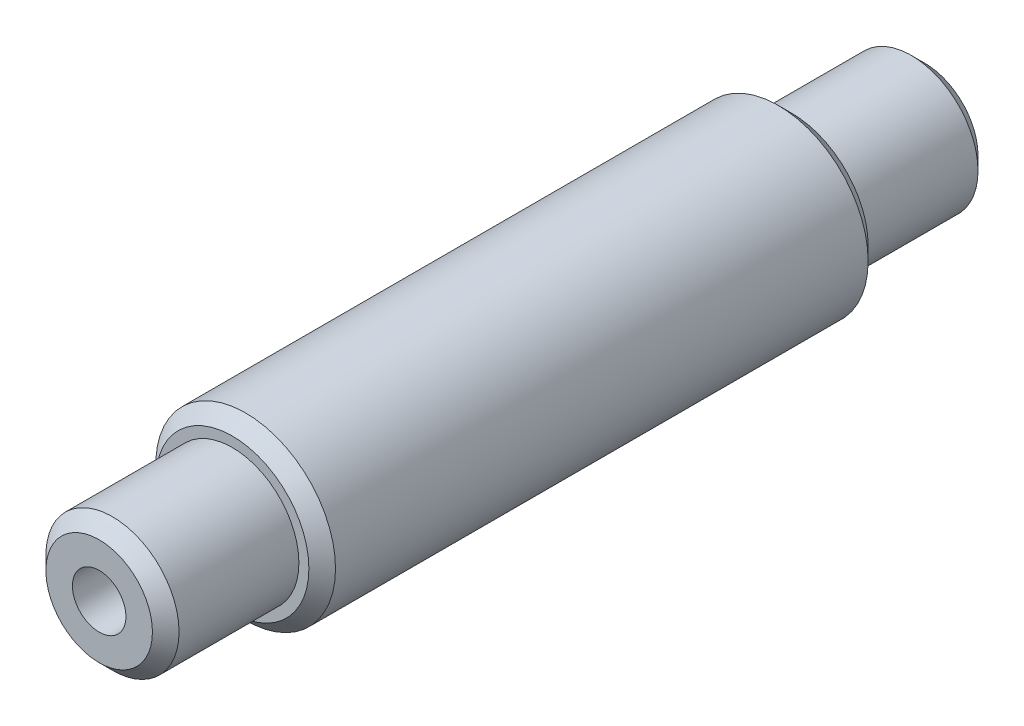
ISO-10303-21;
HEADER;
FILE_DESCRIPTION(('STEP AP214'),'2;1');
FILE_NAME('part.step','',(''),(''),'','','');
FILE_SCHEMA(('AUTOMOTIVE_DESIGN { 1 0 10303 214 1 1 1 1 }'));
ENDSEC;
DATA;
#1=APPLICATION_CONTEXT('core data for automotive mechanical design processes');
#2=APPLICATION_PROTOCOL_DEFINITION('international standard','automotive_design',2000,#1);
#3=PRODUCT_CONTEXT('',#1,'mechanical');
#4=PRODUCT('Part','Part','',(#3));
#5=PRODUCT_RELATED_PRODUCT_CATEGORY('part','',(#4));
#6=PRODUCT_DEFINITION_FORMATION('','',#4);
#7=PRODUCT_DEFINITION_CONTEXT('part definition',#1,'design');
#8=PRODUCT_DEFINITION('design','',#6,#7);
#9=PRODUCT_DEFINITION_SHAPE('','',#8);
#10=(LENGTH_UNIT() NAMED_UNIT(*) SI_UNIT(.MILLI.,.METRE.));
#11=(NAMED_UNIT(*) PLANE_ANGLE_UNIT() SI_UNIT($,.RADIAN.));
#12=(NAMED_UNIT(*) SI_UNIT($,.STERADIAN.) SOLID_ANGLE_UNIT());
#13=UNCERTAINTY_MEASURE_WITH_UNIT(LENGTH_MEASURE(1.E-05),#10,'distance_accuracy_value','');
#14=(GEOMETRIC_REPRESENTATION_CONTEXT(3) GLOBAL_UNCERTAINTY_ASSIGNED_CONTEXT((#13)) GLOBAL_UNIT_ASSIGNED_CONTEXT((#10,
#11,#12)) REPRESENTATION_CONTEXT('',''));
#15=CARTESIAN_POINT('',(0.,0.,0.));
#16=DIRECTION('',(0.,0.,1.));
#17=DIRECTION('',(1.,0.,0.));
#18=AXIS2_PLACEMENT_3D('',#15,#16,#17);
#19=CARTESIAN_POINT('',(0.,0.,26.67));
#20=DIRECTION('',(0.,0.,1.));
#21=DIRECTION('',(1.,0.,0.));
#22=AXIS2_PLACEMENT_3D('',#19,#20,#21);
#23=PLANE('',#22);
#24=CARTESIAN_POINT('',(0.,0.,26.67));
#25=DIRECTION('',(0.,0.,1.));
#26=DIRECTION('',(1.,0.,0.));
#27=AXIS2_PLACEMENT_3D('',#24,#25,#26);
#28=CIRCLE('',#27,7.30250000000001);
#29=CARTESIAN_POINT('',(7.30250000000001,0.,26.67));
#30=VERTEX_POINT('',#29);
#31=EDGE_CURVE('E111',#30,#30,#28,.T.);
#32=ORIENTED_EDGE('',*,*,#31,.T.);
#33=EDGE_LOOP('',(#32));
#34=FACE_BOUND('',#33,.T.);
#35=CARTESIAN_POINT('',(0.,0.,26.67));
#36=DIRECTION('',(0.,0.,1.));
#37=DIRECTION('',(1.,0.,0.));
#38=AXIS2_PLACEMENT_3D('',#35,#36,#37);
#39=CIRCLE('',#38,6.35);
#40=CARTESIAN_POINT('',(6.35,0.,26.67));
#41=VERTEX_POINT('',#40);
#42=EDGE_CURVE('E87',#41,#41,#39,.T.);
#43=ORIENTED_EDGE('',*,*,#42,.F.);
#44=EDGE_LOOP('',(#43));
#45=FACE_BOUND('',#44,.T.);
#46=ADVANCED_FACE('F43',(#34,#45),#23,.T.);
#47=CARTESIAN_POINT('',(0.,0.,-26.67));
#48=DIRECTION('',(0.,0.,1.));
#49=DIRECTION('',(1.,0.,0.));
#50=AXIS2_PLACEMENT_3D('',#47,#48,#49);
#51=PLANE('',#50);
#52=CARTESIAN_POINT('',(0.,0.,-26.67));
#53=DIRECTION('',(0.,0.,1.));
#54=DIRECTION('',(1.,0.,0.));
#55=AXIS2_PLACEMENT_3D('',#52,#53,#54);
#56=CIRCLE('',#55,7.3025);
#57=CARTESIAN_POINT('',(7.3025,0.,-26.67));
#58=VERTEX_POINT('',#57);
#59=EDGE_CURVE('E107',#58,#58,#56,.F.);
#60=ORIENTED_EDGE('',*,*,#59,.T.);
#61=EDGE_LOOP('',(#60));
#62=FACE_BOUND('',#61,.T.);
#63=CARTESIAN_POINT('',(0.,0.,-26.67));
#64=DIRECTION('',(0.,0.,1.));
#65=DIRECTION('',(1.,0.,0.));
#66=AXIS2_PLACEMENT_3D('',#63,#64,#65);
#67=CIRCLE('',#66,6.35);
#68=CARTESIAN_POINT('',(6.35,0.,-26.67));
#69=VERTEX_POINT('',#68);
#70=EDGE_CURVE('E83',#69,#69,#67,.F.);
#71=ORIENTED_EDGE('',*,*,#70,.F.);
#72=EDGE_LOOP('',(#71));
#73=FACE_BOUND('',#72,.T.);
#74=ADVANCED_FACE('F133',(#62,#73),#51,.F.);
#75=CARTESIAN_POINT('',(0.,0.,26.67));
#76=DIRECTION('',(0.,0.,-1.));
#77=DIRECTION('',(-1.,0.,0.));
#78=AXIS2_PLACEMENT_3D('',#75,#76,#77);
#79=CYLINDRICAL_SURFACE('',#78,8.5725);
#80=CARTESIAN_POINT('',(0.,0.,-25.4));
#81=DIRECTION('',(0.,0.,1.));
#82=DIRECTION('',(1.,0.,0.));
#83=AXIS2_PLACEMENT_3D('',#80,#81,#82);
#84=CIRCLE('',#83,8.5725);
#85=CARTESIAN_POINT('',(8.5725,0.,-25.4));
#86=VERTEX_POINT('',#85);
#87=EDGE_CURVE('E103',#86,#86,#84,.T.);
#88=ORIENTED_EDGE('',*,*,#87,.T.);
#89=EDGE_LOOP('',(#88));
#90=FACE_BOUND('',#89,.T.);
#91=CARTESIAN_POINT('',(0.,0.,25.4));
#92=DIRECTION('',(0.,0.,1.));
#93=DIRECTION('',(1.,0.,0.));
#94=AXIS2_PLACEMENT_3D('',#91,#92,#93);
#95=CIRCLE('',#94,8.5725);
#96=CARTESIAN_POINT('',(8.5725,0.,25.4));
#97=VERTEX_POINT('',#96);
#98=EDGE_CURVE('E99',#97,#97,#95,.F.);
#99=ORIENTED_EDGE('',*,*,#98,.T.);
#100=EDGE_LOOP('',(#99));
#101=FACE_BOUND('',#100,.T.);
#102=ADVANCED_FACE('F139',(#90,#101),#79,.T.);
#103=CARTESIAN_POINT('',(0.,0.,-39.37));
#104=DIRECTION('',(0.,0.,1.));
#105=DIRECTION('',(1.,0.,0.));
#106=AXIS2_PLACEMENT_3D('',#103,#104,#105);
#107=PLANE('',#106);
#108=CARTESIAN_POINT('',(0.,0.,-39.37));
#109=DIRECTION('',(0.,0.,-1.));
#110=DIRECTION('',(-1.,0.,0.));
#111=AXIS2_PLACEMENT_3D('',#108,#109,#110);
#112=CIRCLE('',#111,2.55269999999999);
#113=CARTESIAN_POINT('',(-2.55269999999999,0.,-39.37));
#114=VERTEX_POINT('',#113);
#115=EDGE_CURVE('E69',#114,#114,#112,.T.);
#116=ORIENTED_EDGE('',*,*,#115,.F.);
#117=EDGE_LOOP('',(#116));
#118=FACE_BOUND('',#117,.T.);
#119=CARTESIAN_POINT('',(0.,0.,-39.37));
#120=DIRECTION('',(0.,0.,1.));
#121=DIRECTION('',(1.,0.,0.));
#122=AXIS2_PLACEMENT_3D('',#119,#120,#121);
#123=CIRCLE('',#122,5.07999999999999);
#124=CARTESIAN_POINT('',(5.07999999999999,0.,-39.37));
#125=VERTEX_POINT('',#124);
#126=EDGE_CURVE('E95',#125,#125,#123,.F.);
#127=ORIENTED_EDGE('',*,*,#126,.T.);
#128=EDGE_LOOP('',(#127));
#129=FACE_BOUND('',#128,.T.);
#130=ADVANCED_FACE('F149',(#118,#129),#107,.F.);
#131=CARTESIAN_POINT('',(0.,0.,39.37));
#132=DIRECTION('',(0.,0.,-1.));
#133=DIRECTION('',(-1.,0.,0.));
#134=AXIS2_PLACEMENT_3D('',#131,#132,#133);
#135=CYLINDRICAL_SURFACE('',#134,6.35);
#136=CARTESIAN_POINT('',(0.,0.,-38.1));
#137=DIRECTION('',(0.,0.,1.));
#138=DIRECTION('',(1.,0.,0.));
#139=AXIS2_PLACEMENT_3D('',#136,#137,#138);
#140=CIRCLE('',#139,6.35);
#141=CARTESIAN_POINT('',(6.35,0.,-38.1));
#142=VERTEX_POINT('',#141);
#143=EDGE_CURVE('E91',#142,#142,#140,.T.);
#144=ORIENTED_EDGE('',*,*,#143,.T.);
#145=EDGE_LOOP('',(#144));
#146=FACE_BOUND('',#145,.T.);
#147=ORIENTED_EDGE('',*,*,#70,.T.);
#148=EDGE_LOOP('',(#147));
#149=FACE_BOUND('',#148,.T.);
#150=ADVANCED_FACE('F169',(#146,#149),#135,.T.);
#151=CARTESIAN_POINT('',(0.,0.,38.1));
#152=DIRECTION('',(0.,0.,1.));
#153=DIRECTION('',(1.,0.,0.));
#154=AXIS2_PLACEMENT_3D('',#151,#152,#153);
#155=CIRCLE('',#154,6.35);
#156=CARTESIAN_POINT('',(6.35,0.,38.1));
#157=VERTEX_POINT('',#156);
#158=EDGE_CURVE('E11',#157,#157,#155,.F.);
#159=ORIENTED_EDGE('',*,*,#158,.T.);
#160=EDGE_LOOP('',(#159));
#161=FACE_BOUND('',#160,.T.);
#162=ORIENTED_EDGE('',*,*,#42,.T.);
#163=EDGE_LOOP('',(#162));
#164=FACE_BOUND('',#163,.T.);
#165=ADVANCED_FACE('F144',(#161,#164),#135,.T.);
#166=CARTESIAN_POINT('',(0.,0.,39.37));
#167=DIRECTION('',(0.,0.,1.));
#168=DIRECTION('',(1.,0.,0.));
#169=AXIS2_PLACEMENT_3D('',#166,#167,#168);
#170=PLANE('',#169);
#171=CARTESIAN_POINT('',(0.,0.,39.37));
#172=DIRECTION('',(0.,0.,1.));
#173=DIRECTION('',(1.,0.,0.));
#174=AXIS2_PLACEMENT_3D('',#171,#172,#173);
#175=CIRCLE('',#174,2.55269999999999);
#176=CARTESIAN_POINT('',(2.55269999999999,0.,39.37));
#177=VERTEX_POINT('',#176);
#178=EDGE_CURVE('E70',#177,#177,#175,.T.);
#179=ORIENTED_EDGE('',*,*,#178,.F.);
#180=EDGE_LOOP('',(#179));
#181=FACE_BOUND('',#180,.T.);
#182=CARTESIAN_POINT('',(0.,0.,39.37));
#183=DIRECTION('',(0.,0.,1.));
#184=DIRECTION('',(1.,0.,0.));
#185=AXIS2_PLACEMENT_3D('',#182,#183,#184);
#186=CIRCLE('',#185,5.08000000000002);
#187=CARTESIAN_POINT('',(5.08000000000002,0.,39.37));
#188=VERTEX_POINT('',#187);
#189=EDGE_CURVE('E52',#188,#188,#186,.T.);
#190=ORIENTED_EDGE('',*,*,#189,.T.);
#191=EDGE_LOOP('',(#190));
#192=FACE_BOUND('',#191,.T.);
#193=ADVANCED_FACE('F118',(#181,#192),#170,.T.);
#194=CARTESIAN_POINT('',(0.,0.,-38.1));
#195=DIRECTION('',(0.,0.,1.));
#196=DIRECTION('',(1.,0.,0.));
#197=AXIS2_PLACEMENT_3D('',#194,#195,#196);
#198=CONICAL_SURFACE('',#197,6.35,0.785398163397456);
#199=ORIENTED_EDGE('',*,*,#126,.F.);
#200=EDGE_LOOP('',(#199));
#201=FACE_BOUND('',#200,.T.);
#202=ORIENTED_EDGE('',*,*,#143,.F.);
#203=EDGE_LOOP('',(#202));
#204=FACE_BOUND('',#203,.T.);
#205=ADVANCED_FACE('F151',(#201,#204),#198,.T.);
#206=CARTESIAN_POINT('',(0.,0.,-25.4));
#207=DIRECTION('',(0.,0.,1.));
#208=DIRECTION('',(1.,0.,0.));
#209=AXIS2_PLACEMENT_3D('',#206,#207,#208);
#210=CONICAL_SURFACE('',#209,8.5725,0.78539816339745);
#211=ORIENTED_EDGE('',*,*,#59,.F.);
#212=EDGE_LOOP('',(#211));
#213=FACE_BOUND('',#212,.T.);
#214=ORIENTED_EDGE('',*,*,#87,.F.);
#215=EDGE_LOOP('',(#214));
#216=FACE_BOUND('',#215,.T.);
#217=ADVANCED_FACE('F129',(#213,#216),#210,.T.);
#218=CARTESIAN_POINT('',(0.,0.,26.67));
#219=DIRECTION('',(0.,0.,-1.));
#220=DIRECTION('',(-1.,0.,0.));
#221=AXIS2_PLACEMENT_3D('',#218,#219,#220);
#222=CONICAL_SURFACE('',#221,7.30250000000001,0.78539816339745);
#223=ORIENTED_EDGE('',*,*,#98,.F.);
#224=EDGE_LOOP('',(#223));
#225=FACE_BOUND('',#224,.T.);
#226=ORIENTED_EDGE('',*,*,#31,.F.);
#227=EDGE_LOOP('',(#226));
#228=FACE_BOUND('',#227,.T.);
#229=ADVANCED_FACE('F122',(#225,#228),#222,.T.);
#230=CARTESIAN_POINT('',(0.,0.,39.37));
#231=DIRECTION('',(0.,0.,-1.));
#232=DIRECTION('',(-1.,0.,0.));
#233=AXIS2_PLACEMENT_3D('',#230,#231,#232);
#234=CONICAL_SURFACE('',#233,5.08000000000002,0.785398163397445);
#235=ORIENTED_EDGE('',*,*,#158,.F.);
#236=EDGE_LOOP('',(#235));
#237=FACE_BOUND('',#236,.T.);
#238=ORIENTED_EDGE('',*,*,#189,.F.);
#239=EDGE_LOOP('',(#238));
#240=FACE_BOUND('',#239,.T.);
#241=ADVANCED_FACE('F45',(#237,#240),#234,.T.);
#242=CARTESIAN_POINT('',(0.,0.,-13.97));
#243=DIRECTION('',(0.,0.,-1.));
#244=DIRECTION('',(-1.,0.,0.));
#245=AXIS2_PLACEMENT_3D('',#242,#243,#244);
#246=CONICAL_SURFACE('',#245,2.55269999999999,1.02974425867665);
#247=CARTESIAN_POINT('',(0.,0.,-12.4361830978083));
#248=VERTEX_POINT('',#247);
#249=VERTEX_LOOP('',#248);
#250=FACE_BOUND('',#249,.T.);
#251=CARTESIAN_POINT('',(0.,0.,-13.97));
#252=DIRECTION('',(0.,0.,-1.));
#253=DIRECTION('',(-1.,0.,0.));
#254=AXIS2_PLACEMENT_3D('',#251,#252,#253);
#255=CIRCLE('',#254,2.55269999999999);
#256=CARTESIAN_POINT('',(-2.55269999999999,0.,-13.97));
#257=VERTEX_POINT('',#256);
#258=EDGE_CURVE('E75',#257,#257,#255,.T.);
#259=ORIENTED_EDGE('',*,*,#258,.T.);
#260=EDGE_LOOP('',(#259));
#261=FACE_BOUND('',#260,.T.);
#262=ADVANCED_FACE('F121',(#250,#261),#246,.F.);
#263=CARTESIAN_POINT('',(0.,0.,-39.37));
#264=DIRECTION('',(0.,0.,-1.));
#265=DIRECTION('',(-1.,0.,0.));
#266=AXIS2_PLACEMENT_3D('',#263,#264,#265);
#267=CYLINDRICAL_SURFACE('',#266,2.55269999999999);
#268=ORIENTED_EDGE('',*,*,#258,.F.);
#269=EDGE_LOOP('',(#268));
#270=FACE_BOUND('',#269,.T.);
#271=ORIENTED_EDGE('',*,*,#115,.T.);
#272=EDGE_LOOP('',(#271));
#273=FACE_BOUND('',#272,.T.);
#274=ADVANCED_FACE('F62',(#270,#273),#267,.F.);
#275=CARTESIAN_POINT('',(0.,0.,13.97));
#276=DIRECTION('',(0.,0.,1.));
#277=DIRECTION('',(1.,0.,0.));
#278=AXIS2_PLACEMENT_3D('',#275,#276,#277);
#279=CONICAL_SURFACE('',#278,2.55269999999999,1.02974425867665);
#280=CARTESIAN_POINT('',(0.,0.,12.4361830978083));
#281=VERTEX_POINT('',#280);
#282=VERTEX_LOOP('',#281);
#283=FACE_BOUND('',#282,.T.);
#284=CARTESIAN_POINT('',(0.,0.,13.97));
#285=DIRECTION('',(0.,0.,1.));
#286=DIRECTION('',(1.,0.,0.));
#287=AXIS2_PLACEMENT_3D('',#284,#285,#286);
#288=CIRCLE('',#287,2.55269999999999);
#289=CARTESIAN_POINT('',(2.55269999999999,0.,13.97));
#290=VERTEX_POINT('',#289);
#291=EDGE_CURVE('E66',#290,#290,#288,.T.);
#292=ORIENTED_EDGE('',*,*,#291,.T.);
#293=EDGE_LOOP('',(#292));
#294=FACE_BOUND('',#293,.T.);
#295=ADVANCED_FACE('F58',(#283,#294),#279,.F.);
#296=CARTESIAN_POINT('',(0.,0.,39.37));
#297=DIRECTION('',(0.,0.,1.));
#298=DIRECTION('',(1.,0.,0.));
#299=AXIS2_PLACEMENT_3D('',#296,#297,#298);
#300=CYLINDRICAL_SURFACE('',#299,2.55269999999999);
#301=ORIENTED_EDGE('',*,*,#291,.F.);
#302=EDGE_LOOP('',(#301));
#303=FACE_BOUND('',#302,.T.);
#304=ORIENTED_EDGE('',*,*,#178,.T.);
#305=EDGE_LOOP('',(#304));
#306=FACE_BOUND('',#305,.T.);
#307=ADVANCED_FACE('F61',(#303,#306),#300,.F.);
#308=CLOSED_SHELL('',(#46,#74,#102,#130,#150,#165,#193,#205,#217,#229,#241,#262,#274,#295,#307));
#309=MANIFOLD_SOLID_BREP('B2',#308);
#310=ADVANCED_BREP_SHAPE_REPRESENTATION('',(#18,#309),#14);
#311=SHAPE_DEFINITION_REPRESENTATION(#9,#310);
ENDSEC;
END-ISO-10303-21;
